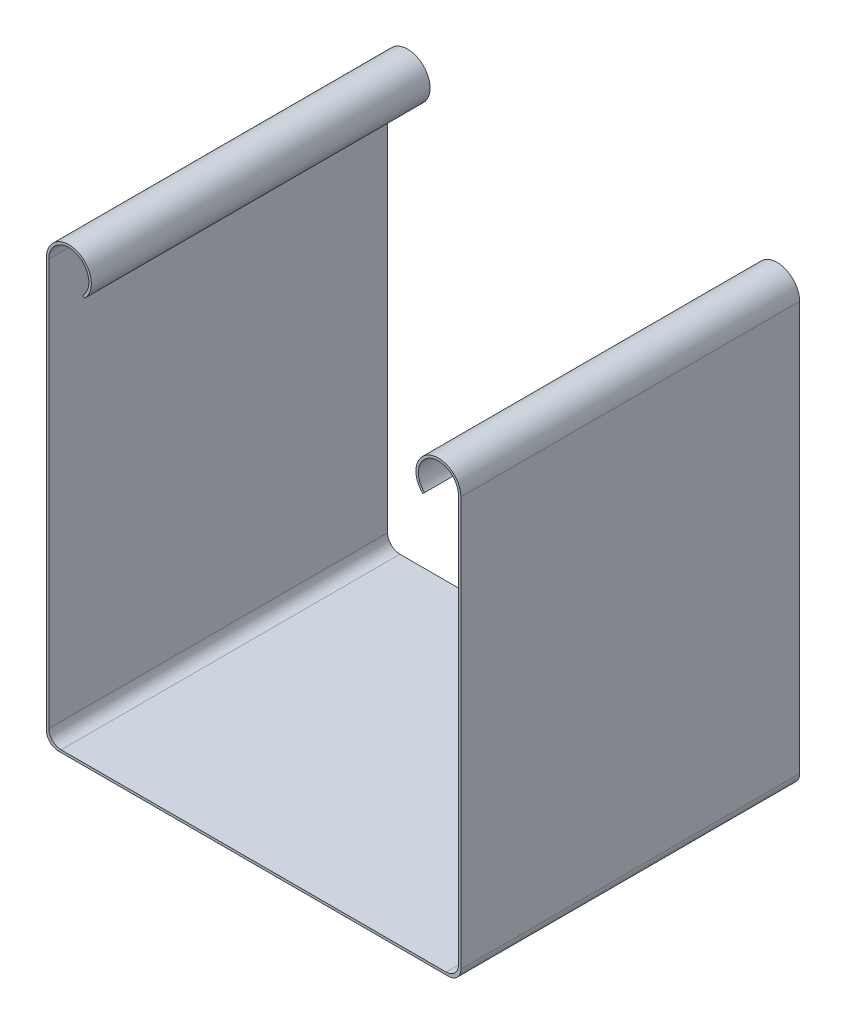
ISO-10303-21;
HEADER;
FILE_DESCRIPTION(('STEP AP214'),'2;1');
FILE_NAME('part.step','',(''),(''),'','','');
FILE_SCHEMA(('AUTOMOTIVE_DESIGN { 1 0 10303 214 1 1 1 1 }'));
ENDSEC;
DATA;
#1=APPLICATION_CONTEXT('core data for automotive mechanical design processes');
#2=APPLICATION_PROTOCOL_DEFINITION('international standard','automotive_design',2000,#1);
#3=PRODUCT_CONTEXT('',#1,'mechanical');
#4=PRODUCT('Part','Part','',(#3));
#5=PRODUCT_RELATED_PRODUCT_CATEGORY('part','',(#4));
#6=PRODUCT_DEFINITION_FORMATION('','',#4);
#7=PRODUCT_DEFINITION_CONTEXT('part definition',#1,'design');
#8=PRODUCT_DEFINITION('design','',#6,#7);
#9=PRODUCT_DEFINITION_SHAPE('','',#8);
#10=(LENGTH_UNIT() NAMED_UNIT(*) SI_UNIT(.MILLI.,.METRE.));
#11=(NAMED_UNIT(*) PLANE_ANGLE_UNIT() SI_UNIT($,.RADIAN.));
#12=(NAMED_UNIT(*) SI_UNIT($,.STERADIAN.) SOLID_ANGLE_UNIT());
#13=UNCERTAINTY_MEASURE_WITH_UNIT(LENGTH_MEASURE(1.E-05),#10,'distance_accuracy_value','');
#14=(GEOMETRIC_REPRESENTATION_CONTEXT(3) GLOBAL_UNCERTAINTY_ASSIGNED_CONTEXT((#13)) GLOBAL_UNIT_ASSIGNED_CONTEXT((#10,
#11,#12)) REPRESENTATION_CONTEXT('',''));
#15=CARTESIAN_POINT('',(0.,0.,0.));
#16=DIRECTION('',(0.,0.,1.));
#17=DIRECTION('',(1.,0.,0.));
#18=AXIS2_PLACEMENT_3D('',#15,#16,#17);
#19=CARTESIAN_POINT('',(33.65,-0.4,55.));
#20=DIRECTION('',(0.,1.,0.));
#21=DIRECTION('',(-1.,0.,0.));
#22=AXIS2_PLACEMENT_3D('',#19,#20,#21);
#23=PLANE('',#22);
#24=DIRECTION('',(1.,0.,0.));
#25=VECTOR('',#24,1.);
#26=CARTESIAN_POINT('',(33.65,-0.4,0.));
#27=LINE('',#26,#25);
#28=CARTESIAN_POINT('',(-31.65,-0.400000000000008,0.));
#29=VERTEX_POINT('',#28);
#30=CARTESIAN_POINT('',(31.65,-0.4,0.));
#31=VERTEX_POINT('',#30);
#32=EDGE_CURVE('E218',#29,#31,#27,.T.);
#33=ORIENTED_EDGE('',*,*,#32,.T.);
#34=DIRECTION('',(0.,0.,-1.));
#35=VECTOR('',#34,1.);
#36=CARTESIAN_POINT('',(31.65,-0.4,55.));
#37=LINE('',#36,#35);
#38=CARTESIAN_POINT('',(31.65,-0.4,55.));
#39=VERTEX_POINT('',#38);
#40=EDGE_CURVE('E48',#31,#39,#37,.F.);
#41=ORIENTED_EDGE('',*,*,#40,.T.);
#42=DIRECTION('',(1.,0.,0.));
#43=VECTOR('',#42,1.);
#44=CARTESIAN_POINT('',(33.65,-0.4,55.));
#45=LINE('',#44,#43);
#46=CARTESIAN_POINT('',(-31.65,-0.400000000000008,55.));
#47=VERTEX_POINT('',#46);
#48=EDGE_CURVE('E219',#47,#39,#45,.T.);
#49=ORIENTED_EDGE('',*,*,#48,.F.);
#50=DIRECTION('',(0.,0.,-1.));
#51=VECTOR('',#50,1.);
#52=CARTESIAN_POINT('',(-31.65,-0.400000000000008,55.));
#53=LINE('',#52,#51);
#54=EDGE_CURVE('E205',#29,#47,#53,.F.);
#55=ORIENTED_EDGE('',*,*,#54,.F.);
#56=EDGE_LOOP('',(#33,#41,#49,#55));
#57=FACE_BOUND('',#56,.T.);
#58=ADVANCED_FACE('F33',(#57),#23,.F.);
#59=CARTESIAN_POINT('',(33.65,68.,55.));
#60=DIRECTION('',(-1.,0.,0.));
#61=DIRECTION('',(0.,0.,1.));
#62=AXIS2_PLACEMENT_3D('',#59,#60,#61);
#63=PLANE('',#62);
#64=DIRECTION('',(0.,1.,0.));
#65=VECTOR('',#64,1.);
#66=CARTESIAN_POINT('',(33.65,34.,55.));
#67=LINE('',#66,#65);
#68=CARTESIAN_POINT('',(33.65,1.6,55.));
#69=VERTEX_POINT('',#68);
#70=CARTESIAN_POINT('',(33.65,68.,55.));
#71=VERTEX_POINT('',#70);
#72=EDGE_CURVE('E221',#69,#71,#67,.T.);
#73=ORIENTED_EDGE('',*,*,#72,.F.);
#74=DIRECTION('',(0.,0.,-1.));
#75=VECTOR('',#74,1.);
#76=CARTESIAN_POINT('',(33.65,1.6,55.));
#77=LINE('',#76,#75);
#78=CARTESIAN_POINT('',(33.65,1.6,0.));
#79=VERTEX_POINT('',#78);
#80=EDGE_CURVE('E266',#69,#79,#77,.T.);
#81=ORIENTED_EDGE('',*,*,#80,.T.);
#82=DIRECTION('',(0.,1.,0.));
#83=VECTOR('',#82,1.);
#84=CARTESIAN_POINT('',(33.65,68.,0.));
#85=LINE('',#84,#83);
#86=CARTESIAN_POINT('',(33.65,68.,0.));
#87=VERTEX_POINT('',#86);
#88=EDGE_CURVE('E237',#79,#87,#85,.T.);
#89=ORIENTED_EDGE('',*,*,#88,.T.);
#90=DIRECTION('',(0.,0.,-1.));
#91=VECTOR('',#90,1.);
#92=CARTESIAN_POINT('',(33.65,68.,55.));
#93=LINE('',#92,#91);
#94=EDGE_CURVE('E258',#71,#87,#93,.T.);
#95=ORIENTED_EDGE('',*,*,#94,.F.);
#96=EDGE_LOOP('',(#73,#81,#89,#95));
#97=FACE_BOUND('',#96,.T.);
#98=ADVANCED_FACE('F306',(#97),#63,.F.);
#99=CARTESIAN_POINT('',(30.,68.,55.));
#100=DIRECTION('',(0.,0.,-1.));
#101=DIRECTION('',(-1.,0.,0.));
#102=AXIS2_PLACEMENT_3D('',#99,#100,#101);
#103=CYLINDRICAL_SURFACE('',#102,3.64999999999999);
#104=CARTESIAN_POINT('',(30.,68.,0.));
#105=DIRECTION('',(0.,0.,1.));
#106=DIRECTION('',(1.,0.,0.));
#107=AXIS2_PLACEMENT_3D('',#104,#105,#106);
#108=CIRCLE('',#107,3.64999999999999);
#109=CARTESIAN_POINT('',(27.4671032395295,65.3718953596178,0.));
#110=VERTEX_POINT('',#109);
#111=EDGE_CURVE('E239',#87,#110,#108,.T.);
#112=ORIENTED_EDGE('',*,*,#111,.T.);
#113=DIRECTION('',(0.,0.,-1.));
#114=VECTOR('',#113,1.);
#115=CARTESIAN_POINT('',(27.4671032395295,65.3718953596178,55.));
#116=LINE('',#115,#114);
#117=CARTESIAN_POINT('',(27.4671032395295,65.3718953596178,55.));
#118=VERTEX_POINT('',#117);
#119=EDGE_CURVE('E255',#118,#110,#116,.T.);
#120=ORIENTED_EDGE('',*,*,#119,.F.);
#121=CARTESIAN_POINT('',(30.,68.,55.));
#122=DIRECTION('',(0.,0.,1.));
#123=DIRECTION('',(1.,0.,0.));
#124=AXIS2_PLACEMENT_3D('',#121,#122,#123);
#125=CIRCLE('',#124,3.64999999999999);
#126=EDGE_CURVE('E224',#71,#118,#125,.T.);
#127=ORIENTED_EDGE('',*,*,#126,.F.);
#128=ORIENTED_EDGE('',*,*,#94,.T.);
#129=EDGE_LOOP('',(#112,#120,#127,#128));
#130=FACE_BOUND('',#129,.T.);
#131=ADVANCED_FACE('F302',(#130),#103,.T.);
#132=CARTESIAN_POINT('',(27.75,65.6547921200883,55.));
#133=DIRECTION('',(-0.70710678118656,0.707106781186534,0.));
#134=DIRECTION('',(-0.707106781186535,-0.707106781186561,0.));
#135=AXIS2_PLACEMENT_3D('',#132,#133,#134);
#136=PLANE('',#135);
#137=DIRECTION('',(0.707106781186534,0.70710678118656,0.));
#138=VECTOR('',#137,1.);
#139=CARTESIAN_POINT('',(27.75,65.6547921200883,0.));
#140=LINE('',#139,#138);
#141=CARTESIAN_POINT('',(27.75,65.6547921200883,0.));
#142=VERTEX_POINT('',#141);
#143=EDGE_CURVE('E241',#110,#142,#140,.T.);
#144=ORIENTED_EDGE('',*,*,#143,.T.);
#145=DIRECTION('',(0.,0.,-1.));
#146=VECTOR('',#145,1.);
#147=CARTESIAN_POINT('',(27.75,65.6547921200883,55.));
#148=LINE('',#147,#146);
#149=CARTESIAN_POINT('',(27.75,65.6547921200883,55.));
#150=VERTEX_POINT('',#149);
#151=EDGE_CURVE('E252',#150,#142,#148,.T.);
#152=ORIENTED_EDGE('',*,*,#151,.F.);
#153=DIRECTION('',(0.707106781186534,0.70710678118656,0.));
#154=VECTOR('',#153,1.);
#155=CARTESIAN_POINT('',(27.75,65.6547921200883,55.));
#156=LINE('',#155,#154);
#157=EDGE_CURVE('E226',#118,#150,#156,.T.);
#158=ORIENTED_EDGE('',*,*,#157,.F.);
#159=ORIENTED_EDGE('',*,*,#119,.T.);
#160=EDGE_LOOP('',(#144,#152,#158,#159));
#161=FACE_BOUND('',#160,.T.);
#162=ADVANCED_FACE('F297',(#161),#136,.F.);
#163=CARTESIAN_POINT('',(30.,68.,55.));
#164=DIRECTION('',(0.,0.,-1.));
#165=DIRECTION('',(-1.,0.,0.));
#166=AXIS2_PLACEMENT_3D('',#163,#164,#165);
#167=CYLINDRICAL_SURFACE('',#166,3.24999999999999);
#168=CARTESIAN_POINT('',(30.,68.,0.));
#169=DIRECTION('',(0.,0.,-1.));
#170=DIRECTION('',(1.,0.,0.));
#171=AXIS2_PLACEMENT_3D('',#168,#169,#170);
#172=CIRCLE('',#171,3.24999999999999);
#173=CARTESIAN_POINT('',(33.25,68.,0.));
#174=VERTEX_POINT('',#173);
#175=EDGE_CURVE('E243',#142,#174,#172,.T.);
#176=ORIENTED_EDGE('',*,*,#175,.T.);
#177=DIRECTION('',(0.,0.,-1.));
#178=VECTOR('',#177,1.);
#179=CARTESIAN_POINT('',(33.25,68.,55.));
#180=LINE('',#179,#178);
#181=CARTESIAN_POINT('',(33.25,68.,55.));
#182=VERTEX_POINT('',#181);
#183=EDGE_CURVE('E235',#182,#174,#180,.T.);
#184=ORIENTED_EDGE('',*,*,#183,.F.);
#185=CARTESIAN_POINT('',(30.,68.,55.));
#186=DIRECTION('',(0.,0.,-1.));
#187=DIRECTION('',(1.,0.,0.));
#188=AXIS2_PLACEMENT_3D('',#185,#186,#187);
#189=CIRCLE('',#188,3.24999999999999);
#190=EDGE_CURVE('E228',#150,#182,#189,.T.);
#191=ORIENTED_EDGE('',*,*,#190,.F.);
#192=ORIENTED_EDGE('',*,*,#151,.T.);
#193=EDGE_LOOP('',(#176,#184,#191,#192));
#194=FACE_BOUND('',#193,.T.);
#195=ADVANCED_FACE('F292',(#194),#167,.F.);
#196=CARTESIAN_POINT('',(33.25,34.,55.));
#197=DIRECTION('',(1.,0.,0.));
#198=DIRECTION('',(0.,0.,-1.));
#199=AXIS2_PLACEMENT_3D('',#196,#197,#198);
#200=PLANE('',#199);
#201=DIRECTION('',(0.,-1.,0.));
#202=VECTOR('',#201,1.);
#203=CARTESIAN_POINT('',(33.25,34.,0.));
#204=LINE('',#203,#202);
#205=CARTESIAN_POINT('',(33.25,2.,0.));
#206=VERTEX_POINT('',#205);
#207=EDGE_CURVE('E246',#174,#206,#204,.T.);
#208=ORIENTED_EDGE('',*,*,#207,.T.);
#209=DIRECTION('',(0.,0.,-1.));
#210=VECTOR('',#209,1.);
#211=CARTESIAN_POINT('',(33.25,2.,55.));
#212=LINE('',#211,#210);
#213=CARTESIAN_POINT('',(33.25,2.,55.));
#214=VERTEX_POINT('',#213);
#215=EDGE_CURVE('E264',#206,#214,#212,.F.);
#216=ORIENTED_EDGE('',*,*,#215,.T.);
#217=DIRECTION('',(0.,-1.,0.));
#218=VECTOR('',#217,1.);
#219=CARTESIAN_POINT('',(33.25,68.,55.));
#220=LINE('',#219,#218);
#221=EDGE_CURVE('E230',#182,#214,#220,.T.);
#222=ORIENTED_EDGE('',*,*,#221,.F.);
#223=ORIENTED_EDGE('',*,*,#183,.T.);
#224=EDGE_LOOP('',(#208,#216,#222,#223));
#225=FACE_BOUND('',#224,.T.);
#226=ADVANCED_FACE('F288',(#225),#200,.F.);
#227=CARTESIAN_POINT('',(33.25,0.,55.));
#228=DIRECTION('',(0.,-1.,0.));
#229=DIRECTION('',(0.,0.,-1.));
#230=AXIS2_PLACEMENT_3D('',#227,#228,#229);
#231=PLANE('',#230);
#232=DIRECTION('',(-1.,0.,0.));
#233=VECTOR('',#232,1.);
#234=CARTESIAN_POINT('',(33.25,0.,55.));
#235=LINE('',#234,#233);
#236=CARTESIAN_POINT('',(31.25,0.,55.));
#237=VERTEX_POINT('',#236);
#238=CARTESIAN_POINT('',(-31.25,0.,55.));
#239=VERTEX_POINT('',#238);
#240=EDGE_CURVE('E233',#237,#239,#235,.T.);
#241=ORIENTED_EDGE('',*,*,#240,.F.);
#242=DIRECTION('',(0.,0.,-1.));
#243=VECTOR('',#242,1.);
#244=CARTESIAN_POINT('',(31.25,0.,0.));
#245=LINE('',#244,#243);
#246=CARTESIAN_POINT('',(31.25,0.,0.));
#247=VERTEX_POINT('',#246);
#248=EDGE_CURVE('E261',#237,#247,#245,.T.);
#249=ORIENTED_EDGE('',*,*,#248,.T.);
#250=DIRECTION('',(-1.,0.,0.));
#251=VECTOR('',#250,1.);
#252=CARTESIAN_POINT('',(33.25,0.,0.));
#253=LINE('',#252,#251);
#254=CARTESIAN_POINT('',(-31.25,0.,0.));
#255=VERTEX_POINT('',#254);
#256=EDGE_CURVE('E222',#247,#255,#253,.T.);
#257=ORIENTED_EDGE('',*,*,#256,.T.);
#258=DIRECTION('',(0.,0.,-1.));
#259=VECTOR('',#258,1.);
#260=CARTESIAN_POINT('',(-31.25,0.,0.));
#261=LINE('',#260,#259);
#262=EDGE_CURVE('E164',#239,#255,#261,.T.);
#263=ORIENTED_EDGE('',*,*,#262,.F.);
#264=EDGE_LOOP('',(#241,#249,#257,#263));
#265=FACE_BOUND('',#264,.T.);
#266=ADVANCED_FACE('F281',(#265),#231,.F.);
#267=CARTESIAN_POINT('',(30.,68.,55.));
#268=DIRECTION('',(0.,0.,1.));
#269=DIRECTION('',(1.,0.,0.));
#270=AXIS2_PLACEMENT_3D('',#267,#268,#269);
#271=PLANE('',#270);
#272=ORIENTED_EDGE('',*,*,#48,.T.);
#273=CARTESIAN_POINT('',(31.65,1.6,55.));
#274=DIRECTION('',(0.,0.,1.));
#275=DIRECTION('',(1.,0.,0.));
#276=AXIS2_PLACEMENT_3D('',#273,#274,#275);
#277=CIRCLE('',#276,2.);
#278=EDGE_CURVE('E11',#39,#69,#277,.T.);
#279=ORIENTED_EDGE('',*,*,#278,.T.);
#280=ORIENTED_EDGE('',*,*,#72,.T.);
#281=ORIENTED_EDGE('',*,*,#126,.T.);
#282=ORIENTED_EDGE('',*,*,#157,.T.);
#283=ORIENTED_EDGE('',*,*,#190,.T.);
#284=ORIENTED_EDGE('',*,*,#221,.T.);
#285=CARTESIAN_POINT('',(31.25,2.,55.));
#286=DIRECTION('',(0.,0.,1.));
#287=DIRECTION('',(1.,0.,0.));
#288=AXIS2_PLACEMENT_3D('',#285,#286,#287);
#289=CIRCLE('',#288,2.);
#290=EDGE_CURVE('E272',#214,#237,#289,.F.);
#291=ORIENTED_EDGE('',*,*,#290,.T.);
#292=ORIENTED_EDGE('',*,*,#240,.T.);
#293=CARTESIAN_POINT('',(-31.25,1.99999999999999,55.));
#294=DIRECTION('',(0.,0.,-1.));
#295=DIRECTION('',(-1.,0.,0.));
#296=AXIS2_PLACEMENT_3D('',#293,#294,#295);
#297=CIRCLE('',#296,2.);
#298=CARTESIAN_POINT('',(-33.25,1.99999999999999,55.));
#299=VERTEX_POINT('',#298);
#300=EDGE_CURVE('E210',#299,#239,#297,.F.);
#301=ORIENTED_EDGE('',*,*,#300,.F.);
#302=DIRECTION('',(0.,-1.,0.));
#303=VECTOR('',#302,1.);
#304=CARTESIAN_POINT('',(-33.25,68.,55.));
#305=LINE('',#304,#303);
#306=CARTESIAN_POINT('',(-33.25,68.,55.));
#307=VERTEX_POINT('',#306);
#308=EDGE_CURVE('E181',#307,#299,#305,.T.);
#309=ORIENTED_EDGE('',*,*,#308,.F.);
#310=CARTESIAN_POINT('',(-30.,68.,55.));
#311=DIRECTION('',(0.,0.,1.));
#312=DIRECTION('',(-1.,0.,0.));
#313=AXIS2_PLACEMENT_3D('',#310,#311,#312);
#314=CIRCLE('',#313,3.24999999999999);
#315=CARTESIAN_POINT('',(-27.75,65.6547921200883,55.));
#316=VERTEX_POINT('',#315);
#317=EDGE_CURVE('E178',#316,#307,#314,.T.);
#318=ORIENTED_EDGE('',*,*,#317,.F.);
#319=DIRECTION('',(-0.707106781186535,0.70710678118656,0.));
#320=VECTOR('',#319,1.);
#321=CARTESIAN_POINT('',(-27.75,65.6547921200883,55.));
#322=LINE('',#321,#320);
#323=CARTESIAN_POINT('',(-27.4671032395296,65.3718953596178,55.));
#324=VERTEX_POINT('',#323);
#325=EDGE_CURVE('E151',#324,#316,#322,.T.);
#326=ORIENTED_EDGE('',*,*,#325,.F.);
#327=CARTESIAN_POINT('',(-30.,68.,55.));
#328=DIRECTION('',(0.,0.,-1.));
#329=DIRECTION('',(-1.,0.,0.));
#330=AXIS2_PLACEMENT_3D('',#327,#328,#329);
#331=CIRCLE('',#330,3.64999999999999);
#332=CARTESIAN_POINT('',(-33.65,68.,55.));
#333=VERTEX_POINT('',#332);
#334=EDGE_CURVE('E144',#333,#324,#331,.T.);
#335=ORIENTED_EDGE('',*,*,#334,.F.);
#336=DIRECTION('',(0.,1.,0.));
#337=VECTOR('',#336,1.);
#338=CARTESIAN_POINT('',(-33.65,34.,55.));
#339=LINE('',#338,#337);
#340=CARTESIAN_POINT('',(-33.65,1.6,55.));
#341=VERTEX_POINT('',#340);
#342=EDGE_CURVE('E149',#341,#333,#339,.T.);
#343=ORIENTED_EDGE('',*,*,#342,.F.);
#344=CARTESIAN_POINT('',(-31.65,1.6,55.));
#345=DIRECTION('',(0.,0.,-1.));
#346=DIRECTION('',(-1.,0.,0.));
#347=AXIS2_PLACEMENT_3D('',#344,#345,#346);
#348=CIRCLE('',#347,2.);
#349=EDGE_CURVE('E216',#47,#341,#348,.T.);
#350=ORIENTED_EDGE('',*,*,#349,.F.);
#351=EDGE_LOOP('',(#272,#279,#280,#281,#282,#283,#284,#291,#292,#301,#309,#318,#326,#335,#343,#350));
#352=FACE_BOUND('',#351,.T.);
#353=ADVANCED_FACE('F146',(#352),#271,.T.);
#354=CARTESIAN_POINT('',(30.,68.,0.));
#355=DIRECTION('',(0.,0.,1.));
#356=DIRECTION('',(1.,0.,0.));
#357=AXIS2_PLACEMENT_3D('',#354,#355,#356);
#358=PLANE('',#357);
#359=ORIENTED_EDGE('',*,*,#88,.F.);
#360=CARTESIAN_POINT('',(31.65,1.6,0.));
#361=DIRECTION('',(0.,0.,1.));
#362=DIRECTION('',(1.,0.,0.));
#363=AXIS2_PLACEMENT_3D('',#360,#361,#362);
#364=CIRCLE('',#363,2.);
#365=EDGE_CURVE('E41',#79,#31,#364,.F.);
#366=ORIENTED_EDGE('',*,*,#365,.T.);
#367=ORIENTED_EDGE('',*,*,#32,.F.);
#368=CARTESIAN_POINT('',(-31.65,1.6,0.));
#369=DIRECTION('',(0.,0.,-1.));
#370=DIRECTION('',(-1.,0.,0.));
#371=AXIS2_PLACEMENT_3D('',#368,#369,#370);
#372=CIRCLE('',#371,2.);
#373=CARTESIAN_POINT('',(-33.65,1.6,0.));
#374=VERTEX_POINT('',#373);
#375=EDGE_CURVE('E213',#374,#29,#372,.F.);
#376=ORIENTED_EDGE('',*,*,#375,.F.);
#377=DIRECTION('',(0.,1.,0.));
#378=VECTOR('',#377,1.);
#379=CARTESIAN_POINT('',(-33.65,68.,0.));
#380=LINE('',#379,#378);
#381=CARTESIAN_POINT('',(-33.65,68.,0.));
#382=VERTEX_POINT('',#381);
#383=EDGE_CURVE('E185',#374,#382,#380,.T.);
#384=ORIENTED_EDGE('',*,*,#383,.T.);
#385=CARTESIAN_POINT('',(-30.,68.,0.));
#386=DIRECTION('',(0.,0.,-1.));
#387=DIRECTION('',(-1.,0.,0.));
#388=AXIS2_PLACEMENT_3D('',#385,#386,#387);
#389=CIRCLE('',#388,3.64999999999999);
#390=CARTESIAN_POINT('',(-27.4671032395296,65.3718953596178,0.));
#391=VERTEX_POINT('',#390);
#392=EDGE_CURVE('E160',#382,#391,#389,.T.);
#393=ORIENTED_EDGE('',*,*,#392,.T.);
#394=DIRECTION('',(-0.707106781186535,0.70710678118656,0.));
#395=VECTOR('',#394,1.);
#396=CARTESIAN_POINT('',(-27.75,65.6547921200883,0.));
#397=LINE('',#396,#395);
#398=CARTESIAN_POINT('',(-27.75,65.6547921200883,0.));
#399=VERTEX_POINT('',#398);
#400=EDGE_CURVE('E188',#391,#399,#397,.T.);
#401=ORIENTED_EDGE('',*,*,#400,.T.);
#402=CARTESIAN_POINT('',(-30.,68.,0.));
#403=DIRECTION('',(0.,0.,1.));
#404=DIRECTION('',(-1.,0.,0.));
#405=AXIS2_PLACEMENT_3D('',#402,#403,#404);
#406=CIRCLE('',#405,3.24999999999999);
#407=CARTESIAN_POINT('',(-33.25,68.,0.));
#408=VERTEX_POINT('',#407);
#409=EDGE_CURVE('E174',#399,#408,#406,.T.);
#410=ORIENTED_EDGE('',*,*,#409,.T.);
#411=DIRECTION('',(0.,-1.,0.));
#412=VECTOR('',#411,1.);
#413=CARTESIAN_POINT('',(-33.25,34.,0.));
#414=LINE('',#413,#412);
#415=CARTESIAN_POINT('',(-33.25,1.99999999999999,0.));
#416=VERTEX_POINT('',#415);
#417=EDGE_CURVE('E171',#408,#416,#414,.T.);
#418=ORIENTED_EDGE('',*,*,#417,.T.);
#419=CARTESIAN_POINT('',(-31.25,1.99999999999999,0.));
#420=DIRECTION('',(0.,0.,-1.));
#421=DIRECTION('',(-1.,0.,0.));
#422=AXIS2_PLACEMENT_3D('',#419,#420,#421);
#423=CIRCLE('',#422,2.);
#424=EDGE_CURVE('E208',#255,#416,#423,.T.);
#425=ORIENTED_EDGE('',*,*,#424,.F.);
#426=ORIENTED_EDGE('',*,*,#256,.F.);
#427=CARTESIAN_POINT('',(31.25,2.,0.));
#428=DIRECTION('',(0.,0.,1.));
#429=DIRECTION('',(1.,0.,0.));
#430=AXIS2_PLACEMENT_3D('',#427,#428,#429);
#431=CIRCLE('',#430,2.);
#432=EDGE_CURVE('E270',#247,#206,#431,.T.);
#433=ORIENTED_EDGE('',*,*,#432,.T.);
#434=ORIENTED_EDGE('',*,*,#207,.F.);
#435=ORIENTED_EDGE('',*,*,#175,.F.);
#436=ORIENTED_EDGE('',*,*,#143,.F.);
#437=ORIENTED_EDGE('',*,*,#111,.F.);
#438=EDGE_LOOP('',(#359,#366,#367,#376,#384,#393,#401,#410,#418,#425,#426,#433,#434,#435,#436,#437));
#439=FACE_BOUND('',#438,.T.);
#440=ADVANCED_FACE('F284',(#439),#358,.F.);
#441=CARTESIAN_POINT('',(31.25,2.,55.));
#442=DIRECTION('',(0.,0.,1.));
#443=DIRECTION('',(1.,0.,0.));
#444=AXIS2_PLACEMENT_3D('',#441,#442,#443);
#445=CYLINDRICAL_SURFACE('',#444,2.);
#446=ORIENTED_EDGE('',*,*,#290,.F.);
#447=ORIENTED_EDGE('',*,*,#215,.F.);
#448=ORIENTED_EDGE('',*,*,#432,.F.);
#449=ORIENTED_EDGE('',*,*,#248,.F.);
#450=EDGE_LOOP('',(#446,#447,#448,#449));
#451=FACE_BOUND('',#450,.T.);
#452=ADVANCED_FACE('F283',(#451),#445,.F.);
#453=CARTESIAN_POINT('',(31.65,1.6,55.));
#454=DIRECTION('',(0.,0.,-1.));
#455=DIRECTION('',(-1.,0.,0.));
#456=AXIS2_PLACEMENT_3D('',#453,#454,#455);
#457=CYLINDRICAL_SURFACE('',#456,2.);
#458=ORIENTED_EDGE('',*,*,#278,.F.);
#459=ORIENTED_EDGE('',*,*,#40,.F.);
#460=ORIENTED_EDGE('',*,*,#365,.F.);
#461=ORIENTED_EDGE('',*,*,#80,.F.);
#462=EDGE_LOOP('',(#458,#459,#460,#461));
#463=FACE_BOUND('',#462,.T.);
#464=ADVANCED_FACE('F35',(#463),#457,.T.);
#465=CARTESIAN_POINT('',(-33.65,68.,55.));
#466=DIRECTION('',(1.,0.,0.));
#467=DIRECTION('',(0.,0.,1.));
#468=AXIS2_PLACEMENT_3D('',#465,#466,#467);
#469=PLANE('',#468);
#470=ORIENTED_EDGE('',*,*,#342,.T.);
#471=DIRECTION('',(0.,0.,-1.));
#472=VECTOR('',#471,1.);
#473=CARTESIAN_POINT('',(-33.65,68.,55.));
#474=LINE('',#473,#472);
#475=EDGE_CURVE('E157',#333,#382,#474,.T.);
#476=ORIENTED_EDGE('',*,*,#475,.T.);
#477=ORIENTED_EDGE('',*,*,#383,.F.);
#478=DIRECTION('',(0.,0.,-1.));
#479=VECTOR('',#478,1.);
#480=CARTESIAN_POINT('',(-33.65,1.6,55.));
#481=LINE('',#480,#479);
#482=EDGE_CURVE('E170',#341,#374,#481,.T.);
#483=ORIENTED_EDGE('',*,*,#482,.F.);
#484=EDGE_LOOP('',(#470,#476,#477,#483));
#485=FACE_BOUND('',#484,.T.);
#486=ADVANCED_FACE('F168',(#485),#469,.F.);
#487=CARTESIAN_POINT('',(-30.,68.,55.));
#488=DIRECTION('',(0.,0.,-1.));
#489=DIRECTION('',(1.,0.,0.));
#490=AXIS2_PLACEMENT_3D('',#487,#488,#489);
#491=CYLINDRICAL_SURFACE('',#490,3.64999999999999);
#492=ORIENTED_EDGE('',*,*,#392,.F.);
#493=ORIENTED_EDGE('',*,*,#475,.F.);
#494=ORIENTED_EDGE('',*,*,#334,.T.);
#495=DIRECTION('',(0.,0.,-1.));
#496=VECTOR('',#495,1.);
#497=CARTESIAN_POINT('',(-27.4671032395296,65.3718953596178,55.));
#498=LINE('',#497,#496);
#499=EDGE_CURVE('E165',#324,#391,#498,.T.);
#500=ORIENTED_EDGE('',*,*,#499,.T.);
#501=EDGE_LOOP('',(#492,#493,#494,#500));
#502=FACE_BOUND('',#501,.T.);
#503=ADVANCED_FACE('F158',(#502),#491,.T.);
#504=CARTESIAN_POINT('',(-27.75,65.6547921200883,55.));
#505=DIRECTION('',(0.70710678118656,0.707106781186535,0.));
#506=DIRECTION('',(0.707106781186535,-0.70710678118656,0.));
#507=AXIS2_PLACEMENT_3D('',#504,#505,#506);
#508=PLANE('',#507);
#509=ORIENTED_EDGE('',*,*,#400,.F.);
#510=ORIENTED_EDGE('',*,*,#499,.F.);
#511=ORIENTED_EDGE('',*,*,#325,.T.);
#512=DIRECTION('',(0.,0.,-1.));
#513=VECTOR('',#512,1.);
#514=CARTESIAN_POINT('',(-27.75,65.6547921200883,55.));
#515=LINE('',#514,#513);
#516=EDGE_CURVE('E195',#316,#399,#515,.T.);
#517=ORIENTED_EDGE('',*,*,#516,.T.);
#518=EDGE_LOOP('',(#509,#510,#511,#517));
#519=FACE_BOUND('',#518,.T.);
#520=ADVANCED_FACE('F314',(#519),#508,.F.);
#521=CARTESIAN_POINT('',(-30.,68.,55.));
#522=DIRECTION('',(0.,0.,-1.));
#523=DIRECTION('',(1.,0.,0.));
#524=AXIS2_PLACEMENT_3D('',#521,#522,#523);
#525=CYLINDRICAL_SURFACE('',#524,3.24999999999999);
#526=ORIENTED_EDGE('',*,*,#409,.F.);
#527=ORIENTED_EDGE('',*,*,#516,.F.);
#528=ORIENTED_EDGE('',*,*,#317,.T.);
#529=DIRECTION('',(0.,0.,-1.));
#530=VECTOR('',#529,1.);
#531=CARTESIAN_POINT('',(-33.25,68.,55.));
#532=LINE('',#531,#530);
#533=EDGE_CURVE('E184',#307,#408,#532,.T.);
#534=ORIENTED_EDGE('',*,*,#533,.T.);
#535=EDGE_LOOP('',(#526,#527,#528,#534));
#536=FACE_BOUND('',#535,.T.);
#537=ADVANCED_FACE('F317',(#536),#525,.F.);
#538=CARTESIAN_POINT('',(-33.25,34.,55.));
#539=DIRECTION('',(-1.,0.,0.));
#540=DIRECTION('',(0.,0.,-1.));
#541=AXIS2_PLACEMENT_3D('',#538,#539,#540);
#542=PLANE('',#541);
#543=ORIENTED_EDGE('',*,*,#417,.F.);
#544=ORIENTED_EDGE('',*,*,#533,.F.);
#545=ORIENTED_EDGE('',*,*,#308,.T.);
#546=DIRECTION('',(0.,0.,-1.));
#547=VECTOR('',#546,1.);
#548=CARTESIAN_POINT('',(-33.25,1.99999999999999,55.));
#549=LINE('',#548,#547);
#550=EDGE_CURVE('E201',#416,#299,#549,.F.);
#551=ORIENTED_EDGE('',*,*,#550,.F.);
#552=EDGE_LOOP('',(#543,#544,#545,#551));
#553=FACE_BOUND('',#552,.T.);
#554=ADVANCED_FACE('F320',(#553),#542,.F.);
#555=CARTESIAN_POINT('',(-31.25,1.99999999999999,55.));
#556=DIRECTION('',(0.,0.,1.));
#557=DIRECTION('',(-1.,0.,0.));
#558=AXIS2_PLACEMENT_3D('',#555,#556,#557);
#559=CYLINDRICAL_SURFACE('',#558,2.);
#560=ORIENTED_EDGE('',*,*,#300,.T.);
#561=ORIENTED_EDGE('',*,*,#262,.T.);
#562=ORIENTED_EDGE('',*,*,#424,.T.);
#563=ORIENTED_EDGE('',*,*,#550,.T.);
#564=EDGE_LOOP('',(#560,#561,#562,#563));
#565=FACE_BOUND('',#564,.T.);
#566=ADVANCED_FACE('F323',(#565),#559,.F.);
#567=CARTESIAN_POINT('',(-31.65,1.6,55.));
#568=DIRECTION('',(0.,0.,-1.));
#569=DIRECTION('',(1.,0.,0.));
#570=AXIS2_PLACEMENT_3D('',#567,#568,#569);
#571=CYLINDRICAL_SURFACE('',#570,2.);
#572=ORIENTED_EDGE('',*,*,#349,.T.);
#573=ORIENTED_EDGE('',*,*,#482,.T.);
#574=ORIENTED_EDGE('',*,*,#375,.T.);
#575=ORIENTED_EDGE('',*,*,#54,.T.);
#576=EDGE_LOOP('',(#572,#573,#574,#575));
#577=FACE_BOUND('',#576,.T.);
#578=ADVANCED_FACE('F312',(#577),#571,.T.);
#579=CLOSED_SHELL('',(#58,#98,#131,#162,#195,#226,#266,#353,#440,#452,#464,#486,#503,#520,#537,
#554,#566,#578));
#580=MANIFOLD_SOLID_BREP('B2',#579);
#581=ADVANCED_BREP_SHAPE_REPRESENTATION('',(#18,#580),#14);
#582=SHAPE_DEFINITION_REPRESENTATION(#9,#581);
ENDSEC;
END-ISO-10303-21;
